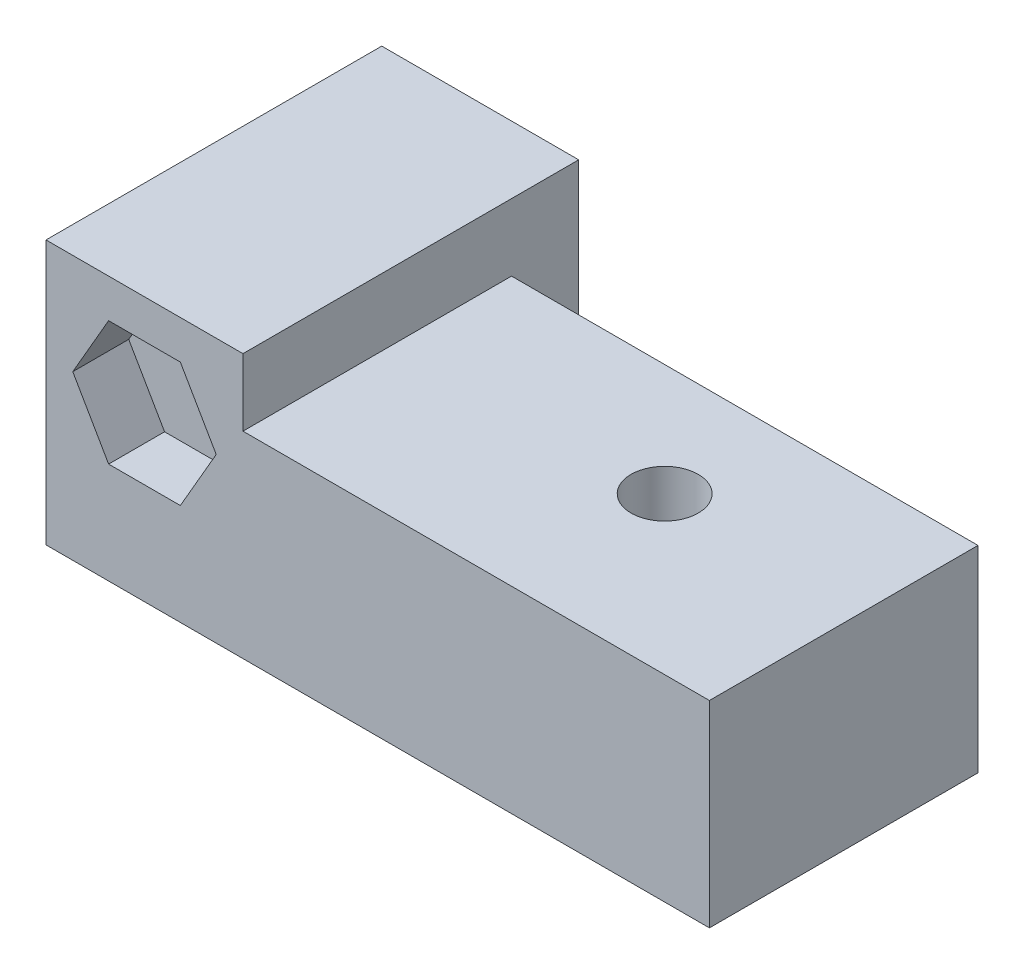
ISO-10303-21;
HEADER;
FILE_DESCRIPTION(('STEP AP214'),'2;1');
FILE_NAME('part.step','',(''),(''),'','','');
FILE_SCHEMA(('AUTOMOTIVE_DESIGN { 1 0 10303 214 1 1 1 1 }'));
ENDSEC;
DATA;
#1=APPLICATION_CONTEXT('core data for automotive mechanical design processes');
#2=APPLICATION_PROTOCOL_DEFINITION('international standard','automotive_design',2000,#1);
#3=PRODUCT_CONTEXT('',#1,'mechanical');
#4=PRODUCT('Part','Part','',(#3));
#5=PRODUCT_RELATED_PRODUCT_CATEGORY('part','',(#4));
#6=PRODUCT_DEFINITION_FORMATION('','',#4);
#7=PRODUCT_DEFINITION_CONTEXT('part definition',#1,'design');
#8=PRODUCT_DEFINITION('design','',#6,#7);
#9=PRODUCT_DEFINITION_SHAPE('','',#8);
#10=(LENGTH_UNIT() NAMED_UNIT(*) SI_UNIT(.MILLI.,.METRE.));
#11=(NAMED_UNIT(*) PLANE_ANGLE_UNIT() SI_UNIT($,.RADIAN.));
#12=(NAMED_UNIT(*) SI_UNIT($,.STERADIAN.) SOLID_ANGLE_UNIT());
#13=UNCERTAINTY_MEASURE_WITH_UNIT(LENGTH_MEASURE(1.E-05),#10,'distance_accuracy_value','');
#14=(GEOMETRIC_REPRESENTATION_CONTEXT(3) GLOBAL_UNCERTAINTY_ASSIGNED_CONTEXT((#13)) GLOBAL_UNIT_ASSIGNED_CONTEXT((#10,
#11,#12)) REPRESENTATION_CONTEXT('',''));
#15=CARTESIAN_POINT('',(0.,0.,0.));
#16=DIRECTION('',(0.,0.,1.));
#17=DIRECTION('',(1.,0.,0.));
#18=AXIS2_PLACEMENT_3D('',#15,#16,#17);
#19=CARTESIAN_POINT('',(-4.4,-0.218543147208115,5.));
#20=DIRECTION('',(0.,-1.,0.));
#21=DIRECTION('',(0.,0.,-1.));
#22=AXIS2_PLACEMENT_3D('',#19,#20,#21);
#23=CYLINDRICAL_SURFACE('',#22,1.5);
#24=CARTESIAN_POINT('',(-4.4,-8.21954314720811,5.));
#25=DIRECTION('',(0.,-1.,0.));
#26=DIRECTION('',(1.,0.,0.));
#27=AXIS2_PLACEMENT_3D('',#24,#25,#26);
#28=CIRCLE('',#27,1.5);
#29=CARTESIAN_POINT('',(-2.9,-8.21954314720811,5.));
#30=VERTEX_POINT('',#29);
#31=EDGE_CURVE('E239',#30,#30,#28,.T.);
#32=ORIENTED_EDGE('',*,*,#31,.F.);
#33=EDGE_LOOP('',(#32));
#34=FACE_BOUND('',#33,.T.);
#35=CARTESIAN_POINT('',(-4.4,-10.7195431472081,5.));
#36=DIRECTION('',(0.,-1.,0.));
#37=DIRECTION('',(0.,0.,-1.));
#38=AXIS2_PLACEMENT_3D('',#35,#36,#37);
#39=CIRCLE('',#38,1.5);
#40=CARTESIAN_POINT('',(-4.4,-10.7195431472081,3.5));
#41=VERTEX_POINT('',#40);
#42=EDGE_CURVE('E37',#41,#41,#39,.T.);
#43=ORIENTED_EDGE('',*,*,#42,.T.);
#44=EDGE_LOOP('',(#43));
#45=FACE_BOUND('',#44,.T.);
#46=ADVANCED_FACE('F33',(#34,#45),#23,.F.);
#47=CARTESIAN_POINT('',(-6.8,-1.21954314720812,15.));
#48=DIRECTION('',(1.,0.,0.));
#49=DIRECTION('',(0.,0.,-1.));
#50=AXIS2_PLACEMENT_3D('',#47,#48,#49);
#51=PLANE('',#50);
#52=DIRECTION('',(0.,-1.,0.));
#53=VECTOR('',#52,1.);
#54=CARTESIAN_POINT('',(-6.8,-1.21954314720812,10.));
#55=LINE('',#54,#53);
#56=CARTESIAN_POINT('',(-6.8,-1.21954314720812,10.));
#57=VERTEX_POINT('',#56);
#58=CARTESIAN_POINT('',(-6.8,-8.21954314720811,10.));
#59=VERTEX_POINT('',#58);
#60=EDGE_CURVE('E222',#57,#59,#55,.T.);
#61=ORIENTED_EDGE('',*,*,#60,.T.);
#62=DIRECTION('',(0.,0.,-1.));
#63=VECTOR('',#62,1.);
#64=CARTESIAN_POINT('',(-6.8,-8.21954314720811,15.));
#65=LINE('',#64,#63);
#66=CARTESIAN_POINT('',(-6.8,-8.21954314720811,0.));
#67=VERTEX_POINT('',#66);
#68=EDGE_CURVE('E233',#59,#67,#65,.T.);
#69=ORIENTED_EDGE('',*,*,#68,.T.);
#70=DIRECTION('',(0.,-1.,0.));
#71=VECTOR('',#70,1.);
#72=CARTESIAN_POINT('',(-6.8,-1.21954314720812,0.));
#73=LINE('',#72,#71);
#74=CARTESIAN_POINT('',(-6.8,-1.21954314720812,0.));
#75=VERTEX_POINT('',#74);
#76=EDGE_CURVE('E397',#75,#67,#73,.T.);
#77=ORIENTED_EDGE('',*,*,#76,.F.);
#78=DIRECTION('',(0.,0.,-1.));
#79=VECTOR('',#78,1.);
#80=CARTESIAN_POINT('',(-6.8,-1.21954314720812,15.));
#81=LINE('',#80,#79);
#82=EDGE_CURVE('E406',#57,#75,#81,.T.);
#83=ORIENTED_EDGE('',*,*,#82,.F.);
#84=EDGE_LOOP('',(#61,#69,#77,#83));
#85=FACE_BOUND('',#84,.T.);
#86=ADVANCED_FACE('F492',(#85),#51,.T.);
#87=CARTESIAN_POINT('',(-6.8,-8.21954314720811,15.));
#88=DIRECTION('',(0.,1.,0.));
#89=DIRECTION('',(0.,0.,1.));
#90=AXIS2_PLACEMENT_3D('',#87,#88,#89);
#91=PLANE('',#90);
#92=ORIENTED_EDGE('',*,*,#68,.F.);
#93=DIRECTION('',(-1.,0.,0.));
#94=VECTOR('',#93,1.);
#95=CARTESIAN_POINT('',(-6.8,-8.21954314720811,10.));
#96=LINE('',#95,#94);
#97=CARTESIAN_POINT('',(-2.,-8.21954314720812,10.));
#98=VERTEX_POINT('',#97);
#99=EDGE_CURVE('E217',#98,#59,#96,.T.);
#100=ORIENTED_EDGE('',*,*,#99,.F.);
#101=DIRECTION('',(0.,0.,-1.));
#102=VECTOR('',#101,1.);
#103=CARTESIAN_POINT('',(-2.,-8.21954314720811,15.));
#104=LINE('',#103,#102);
#105=CARTESIAN_POINT('',(-2.,-8.21954314720811,0.));
#106=VERTEX_POINT('',#105);
#107=EDGE_CURVE('E226',#98,#106,#104,.T.);
#108=ORIENTED_EDGE('',*,*,#107,.T.);
#109=DIRECTION('',(1.,0.,0.));
#110=VECTOR('',#109,1.);
#111=CARTESIAN_POINT('',(-6.8,-8.21954314720811,0.));
#112=LINE('',#111,#110);
#113=EDGE_CURVE('E400',#67,#106,#112,.T.);
#114=ORIENTED_EDGE('',*,*,#113,.F.);
#115=EDGE_LOOP('',(#92,#100,#108,#114));
#116=FACE_BOUND('',#115,.T.);
#117=ORIENTED_EDGE('',*,*,#31,.T.);
#118=EDGE_LOOP('',(#117));
#119=FACE_BOUND('',#118,.T.);
#120=ADVANCED_FACE('F237',(#116,#119),#91,.T.);
#121=CARTESIAN_POINT('',(-2.,-8.21954314720811,15.));
#122=DIRECTION('',(-1.,0.,0.));
#123=DIRECTION('',(0.,0.,1.));
#124=AXIS2_PLACEMENT_3D('',#121,#122,#123);
#125=PLANE('',#124);
#126=ORIENTED_EDGE('',*,*,#107,.F.);
#127=DIRECTION('',(0.,-1.,0.));
#128=VECTOR('',#127,1.);
#129=CARTESIAN_POINT('',(-2.,-8.21954314720812,10.));
#130=LINE('',#129,#128);
#131=CARTESIAN_POINT('',(-2.,-1.21954314720811,10.));
#132=VERTEX_POINT('',#131);
#133=EDGE_CURVE('E213',#132,#98,#130,.T.);
#134=ORIENTED_EDGE('',*,*,#133,.F.);
#135=DIRECTION('',(0.,0.,-1.));
#136=VECTOR('',#135,1.);
#137=CARTESIAN_POINT('',(-2.,-1.21954314720811,15.));
#138=LINE('',#137,#136);
#139=CARTESIAN_POINT('',(-2.,-1.21954314720811,0.));
#140=VERTEX_POINT('',#139);
#141=EDGE_CURVE('E234',#132,#140,#138,.T.);
#142=ORIENTED_EDGE('',*,*,#141,.T.);
#143=DIRECTION('',(0.,1.,0.));
#144=VECTOR('',#143,1.);
#145=CARTESIAN_POINT('',(-2.,-8.21954314720811,0.));
#146=LINE('',#145,#144);
#147=EDGE_CURVE('E229',#106,#140,#146,.T.);
#148=ORIENTED_EDGE('',*,*,#147,.F.);
#149=EDGE_LOOP('',(#126,#134,#142,#148));
#150=FACE_BOUND('',#149,.T.);
#151=ADVANCED_FACE('F227',(#150),#125,.T.);
#152=CARTESIAN_POINT('',(-2.,-1.21954314720811,15.));
#153=DIRECTION('',(0.,-1.,0.));
#154=DIRECTION('',(1.,0.,0.));
#155=AXIS2_PLACEMENT_3D('',#152,#153,#154);
#156=PLANE('',#155);
#157=ORIENTED_EDGE('',*,*,#141,.F.);
#158=DIRECTION('',(-1.,0.,0.));
#159=VECTOR('',#158,1.);
#160=CARTESIAN_POINT('',(-2.,-1.21954314720811,10.));
#161=LINE('',#160,#159);
#162=EDGE_CURVE('E219',#132,#57,#161,.T.);
#163=ORIENTED_EDGE('',*,*,#162,.T.);
#164=ORIENTED_EDGE('',*,*,#82,.T.);
#165=DIRECTION('',(-1.,0.,0.));
#166=VECTOR('',#165,1.);
#167=CARTESIAN_POINT('',(-2.,-1.21954314720811,0.));
#168=LINE('',#167,#166);
#169=EDGE_CURVE('E403',#140,#75,#168,.T.);
#170=ORIENTED_EDGE('',*,*,#169,.F.);
#171=EDGE_LOOP('',(#157,#163,#164,#170));
#172=FACE_BOUND('',#171,.T.);
#173=ADVANCED_FACE('F544',(#172),#156,.T.);
#174=CARTESIAN_POINT('',(-8.8,-0.219543147208115,15.));
#175=DIRECTION('',(0.,0.,1.));
#176=DIRECTION('',(1.,0.,0.));
#177=AXIS2_PLACEMENT_3D('',#174,#175,#176);
#178=PLANE('',#177);
#179=DIRECTION('',(0.5,0.866025403784439,0.));
#180=VECTOR('',#179,1.);
#181=CARTESIAN_POINT('',(-2.79785300299879,-7.49454314720812,15.));
#182=LINE('',#181,#180);
#183=CARTESIAN_POINT('',(-2.79785300299879,-7.49454314720812,15.));
#184=VERTEX_POINT('',#183);
#185=CARTESIAN_POINT('',(-1.19570600599758,-4.71954314720811,15.));
#186=VERTEX_POINT('',#185);
#187=EDGE_CURVE('E313',#184,#186,#182,.T.);
#188=ORIENTED_EDGE('',*,*,#187,.F.);
#189=DIRECTION('',(1.,0.,0.));
#190=VECTOR('',#189,1.);
#191=CARTESIAN_POINT('',(-6.00214699700121,-7.49454314720812,15.));
#192=LINE('',#191,#190);
#193=CARTESIAN_POINT('',(-6.00214699700121,-7.49454314720812,15.));
#194=VERTEX_POINT('',#193);
#195=EDGE_CURVE('E326',#194,#184,#192,.T.);
#196=ORIENTED_EDGE('',*,*,#195,.F.);
#197=DIRECTION('',(0.5,-0.866025403784438,0.));
#198=VECTOR('',#197,1.);
#199=CARTESIAN_POINT('',(-7.60429399400242,-4.71954314720811,15.));
#200=LINE('',#199,#198);
#201=CARTESIAN_POINT('',(-7.60429399400242,-4.71954314720811,15.));
#202=VERTEX_POINT('',#201);
#203=EDGE_CURVE('E352',#202,#194,#200,.T.);
#204=ORIENTED_EDGE('',*,*,#203,.F.);
#205=DIRECTION('',(-0.5,-0.866025403784439,0.));
#206=VECTOR('',#205,1.);
#207=CARTESIAN_POINT('',(-6.00214699700121,-1.94454314720811,15.));
#208=LINE('',#207,#206);
#209=CARTESIAN_POINT('',(-6.00214699700121,-1.94454314720811,15.));
#210=VERTEX_POINT('',#209);
#211=EDGE_CURVE('E349',#210,#202,#208,.T.);
#212=ORIENTED_EDGE('',*,*,#211,.F.);
#213=DIRECTION('',(-1.,0.,0.));
#214=VECTOR('',#213,1.);
#215=CARTESIAN_POINT('',(-2.79785300299879,-1.94454314720811,15.));
#216=LINE('',#215,#214);
#217=CARTESIAN_POINT('',(-2.79785300299879,-1.94454314720811,15.));
#218=VERTEX_POINT('',#217);
#219=EDGE_CURVE('E346',#218,#210,#216,.T.);
#220=ORIENTED_EDGE('',*,*,#219,.F.);
#221=DIRECTION('',(-0.5,0.866025403784438,0.));
#222=VECTOR('',#221,1.);
#223=CARTESIAN_POINT('',(-1.19570600599757,-4.71954314720811,15.));
#224=LINE('',#223,#222);
#225=EDGE_CURVE('E343',#186,#218,#224,.T.);
#226=ORIENTED_EDGE('',*,*,#225,.F.);
#227=EDGE_LOOP('',(#188,#196,#204,#212,#220,#226));
#228=FACE_BOUND('',#227,.T.);
#229=DIRECTION('',(-1.,0.,0.));
#230=VECTOR('',#229,1.);
#231=CARTESIAN_POINT('',(20.84,-3.21954314720811,15.));
#232=LINE('',#231,#230);
#233=CARTESIAN_POINT('',(20.84,-3.21954314720811,15.));
#234=VERTEX_POINT('',#233);
#235=CARTESIAN_POINT('',(0.,-3.21954314720811,15.));
#236=VERTEX_POINT('',#235);
#237=EDGE_CURVE('E387',#234,#236,#232,.T.);
#238=ORIENTED_EDGE('',*,*,#237,.T.);
#239=DIRECTION('',(0.,1.,0.));
#240=VECTOR('',#239,1.);
#241=CARTESIAN_POINT('',(0.,-0.219543147208115,15.));
#242=LINE('',#241,#240);
#243=CARTESIAN_POINT('',(0.,-0.219543147208115,15.));
#244=VERTEX_POINT('',#243);
#245=EDGE_CURVE('E418',#236,#244,#242,.T.);
#246=ORIENTED_EDGE('',*,*,#245,.T.);
#247=DIRECTION('',(-1.,0.,0.));
#248=VECTOR('',#247,1.);
#249=CARTESIAN_POINT('',(-6.8,-0.219543147208115,15.));
#250=LINE('',#249,#248);
#251=CARTESIAN_POINT('',(-8.8,-0.219543147208115,15.));
#252=VERTEX_POINT('',#251);
#253=EDGE_CURVE('E411',#244,#252,#250,.T.);
#254=ORIENTED_EDGE('',*,*,#253,.T.);
#255=DIRECTION('',(0.,-1.,0.));
#256=VECTOR('',#255,1.);
#257=CARTESIAN_POINT('',(-8.8,-0.219543147208115,15.));
#258=LINE('',#257,#256);
#259=CARTESIAN_POINT('',(-8.8,-12.0195431472081,15.));
#260=VERTEX_POINT('',#259);
#261=EDGE_CURVE('E414',#252,#260,#258,.T.);
#262=ORIENTED_EDGE('',*,*,#261,.T.);
#263=DIRECTION('',(-1.,0.,0.));
#264=VECTOR('',#263,1.);
#265=CARTESIAN_POINT('',(20.84,-12.0195431472081,15.));
#266=LINE('',#265,#264);
#267=CARTESIAN_POINT('',(20.84,-12.0195431472081,15.));
#268=VERTEX_POINT('',#267);
#269=EDGE_CURVE('E389',#268,#260,#266,.T.);
#270=ORIENTED_EDGE('',*,*,#269,.F.);
#271=DIRECTION('',(0.,1.,0.));
#272=VECTOR('',#271,1.);
#273=CARTESIAN_POINT('',(20.84,-3.21954314720811,15.));
#274=LINE('',#273,#272);
#275=EDGE_CURVE('E376',#268,#234,#274,.T.);
#276=ORIENTED_EDGE('',*,*,#275,.T.);
#277=EDGE_LOOP('',(#238,#246,#254,#262,#270,#276));
#278=FACE_BOUND('',#277,.T.);
#279=ADVANCED_FACE('F471',(#228,#278),#178,.T.);
#280=CARTESIAN_POINT('',(-8.8,-0.219543147208115,0.));
#281=DIRECTION('',(0.,0.,1.));
#282=DIRECTION('',(1.,0.,0.));
#283=AXIS2_PLACEMENT_3D('',#280,#281,#282);
#284=PLANE('',#283);
#285=DIRECTION('',(0.,-1.,0.));
#286=VECTOR('',#285,1.);
#287=CARTESIAN_POINT('',(-8.8,-0.219543147208115,0.));
#288=LINE('',#287,#286);
#289=CARTESIAN_POINT('',(-8.8,-0.219543147208115,0.));
#290=VERTEX_POINT('',#289);
#291=CARTESIAN_POINT('',(-8.8,-11.2195431472081,0.));
#292=VERTEX_POINT('',#291);
#293=EDGE_CURVE('E410',#290,#292,#288,.T.);
#294=ORIENTED_EDGE('',*,*,#293,.F.);
#295=DIRECTION('',(-1.,0.,0.));
#296=VECTOR('',#295,1.);
#297=CARTESIAN_POINT('',(-6.8,-0.219543147208115,0.));
#298=LINE('',#297,#296);
#299=CARTESIAN_POINT('',(0.,-0.219543147208115,0.));
#300=VERTEX_POINT('',#299);
#301=EDGE_CURVE('E415',#300,#290,#298,.T.);
#302=ORIENTED_EDGE('',*,*,#301,.F.);
#303=DIRECTION('',(0.,1.,0.));
#304=VECTOR('',#303,1.);
#305=CARTESIAN_POINT('',(0.,-0.219543147208115,0.));
#306=LINE('',#305,#304);
#307=CARTESIAN_POINT('',(0.,-11.2195431472081,0.));
#308=VERTEX_POINT('',#307);
#309=EDGE_CURVE('E426',#308,#300,#306,.T.);
#310=ORIENTED_EDGE('',*,*,#309,.F.);
#311=DIRECTION('',(1.,0.,0.));
#312=VECTOR('',#311,1.);
#313=CARTESIAN_POINT('',(0.,-11.2195431472081,0.));
#314=LINE('',#313,#312);
#315=EDGE_CURVE('E423',#292,#308,#314,.T.);
#316=ORIENTED_EDGE('',*,*,#315,.F.);
#317=EDGE_LOOP('',(#294,#302,#310,#316));
#318=FACE_BOUND('',#317,.T.);
#319=ORIENTED_EDGE('',*,*,#76,.T.);
#320=ORIENTED_EDGE('',*,*,#113,.T.);
#321=ORIENTED_EDGE('',*,*,#147,.T.);
#322=ORIENTED_EDGE('',*,*,#169,.T.);
#323=EDGE_LOOP('',(#319,#320,#321,#322));
#324=FACE_BOUND('',#323,.T.);
#325=ADVANCED_FACE('F482',(#318,#324),#284,.F.);
#326=CARTESIAN_POINT('',(-8.8,-0.219543147208115,15.));
#327=DIRECTION('',(1.,0.,0.));
#328=DIRECTION('',(0.,1.,0.));
#329=AXIS2_PLACEMENT_3D('',#326,#327,#328);
#330=PLANE('',#329);
#331=DIRECTION('',(0.,1.,0.));
#332=VECTOR('',#331,1.);
#333=CARTESIAN_POINT('',(-8.8,-13.2195431472081,9.4));
#334=LINE('',#333,#332);
#335=CARTESIAN_POINT('',(-8.8,-13.2195431472081,9.4));
#336=VERTEX_POINT('',#335);
#337=CARTESIAN_POINT('',(-8.8,-12.0195431472081,9.4));
#338=VERTEX_POINT('',#337);
#339=EDGE_CURVE('E308',#336,#338,#334,.T.);
#340=ORIENTED_EDGE('',*,*,#339,.T.);
#341=DIRECTION('',(0.,0.,1.));
#342=VECTOR('',#341,1.);
#343=CARTESIAN_POINT('',(-8.8,-12.0195431472081,3.));
#344=LINE('',#343,#342);
#345=EDGE_CURVE('E359',#338,#260,#344,.T.);
#346=ORIENTED_EDGE('',*,*,#345,.T.);
#347=ORIENTED_EDGE('',*,*,#261,.F.);
#348=DIRECTION('',(0.,0.,-1.));
#349=VECTOR('',#348,1.);
#350=CARTESIAN_POINT('',(-8.8,-0.219543147208115,15.));
#351=LINE('',#350,#349);
#352=EDGE_CURVE('E435',#252,#290,#351,.T.);
#353=ORIENTED_EDGE('',*,*,#352,.T.);
#354=ORIENTED_EDGE('',*,*,#293,.T.);
#355=DIRECTION('',(0.,0.,-1.));
#356=VECTOR('',#355,1.);
#357=CARTESIAN_POINT('',(-8.8,-11.2195431472081,15.));
#358=LINE('',#357,#356);
#359=CARTESIAN_POINT('',(-8.8,-11.2195431472081,0.6));
#360=VERTEX_POINT('',#359);
#361=EDGE_CURVE('E433',#360,#292,#358,.T.);
#362=ORIENTED_EDGE('',*,*,#361,.F.);
#363=DIRECTION('',(0.,1.,0.));
#364=VECTOR('',#363,1.);
#365=CARTESIAN_POINT('',(-8.8,-13.2195431472081,0.600000000000002));
#366=LINE('',#365,#364);
#367=CARTESIAN_POINT('',(-8.8,-13.2195431472081,0.600000000000002));
#368=VERTEX_POINT('',#367);
#369=EDGE_CURVE('E310',#368,#360,#366,.T.);
#370=ORIENTED_EDGE('',*,*,#369,.F.);
#371=DIRECTION('',(0.,0.,1.));
#372=VECTOR('',#371,1.);
#373=CARTESIAN_POINT('',(-8.8,-13.2195431472081,0.600000000000002));
#374=LINE('',#373,#372);
#375=EDGE_CURVE('E296',#368,#336,#374,.T.);
#376=ORIENTED_EDGE('',*,*,#375,.T.);
#377=EDGE_LOOP('',(#340,#346,#347,#353,#354,#362,#370,#376));
#378=FACE_BOUND('',#377,.T.);
#379=ADVANCED_FACE('F35',(#378),#330,.F.);
#380=CARTESIAN_POINT('',(0.,-11.2195431472081,15.));
#381=DIRECTION('',(0.,1.,0.));
#382=DIRECTION('',(0.,0.,1.));
#383=AXIS2_PLACEMENT_3D('',#380,#381,#382);
#384=PLANE('',#383);
#385=DIRECTION('',(0.,0.,-1.));
#386=VECTOR('',#385,1.);
#387=CARTESIAN_POINT('',(0.,-11.2195431472081,15.));
#388=LINE('',#387,#386);
#389=CARTESIAN_POINT('',(0.,-11.2195431472081,0.6));
#390=VERTEX_POINT('',#389);
#391=EDGE_CURVE('E431',#390,#308,#388,.T.);
#392=ORIENTED_EDGE('',*,*,#391,.F.);
#393=DIRECTION('',(-1.,0.,0.));
#394=VECTOR('',#393,1.);
#395=CARTESIAN_POINT('',(-8.8,-11.2195431472081,0.600000000000002));
#396=LINE('',#395,#394);
#397=EDGE_CURVE('E57',#390,#360,#396,.T.);
#398=ORIENTED_EDGE('',*,*,#397,.T.);
#399=ORIENTED_EDGE('',*,*,#361,.T.);
#400=ORIENTED_EDGE('',*,*,#315,.T.);
#401=EDGE_LOOP('',(#392,#398,#399,#400));
#402=FACE_BOUND('',#401,.T.);
#403=ADVANCED_FACE('F484',(#402),#384,.F.);
#404=CARTESIAN_POINT('',(0.,-0.219543147208115,15.));
#405=DIRECTION('',(-1.,0.,0.));
#406=DIRECTION('',(0.,-1.,0.));
#407=AXIS2_PLACEMENT_3D('',#404,#405,#406);
#408=PLANE('',#407);
#409=DIRECTION('',(0.,0.,-1.));
#410=VECTOR('',#409,1.);
#411=CARTESIAN_POINT('',(0.,-3.21954314720811,15.));
#412=LINE('',#411,#410);
#413=CARTESIAN_POINT('',(0.,-3.21954314720811,3.));
#414=VERTEX_POINT('',#413);
#415=EDGE_CURVE('E223',#236,#414,#412,.T.);
#416=ORIENTED_EDGE('',*,*,#415,.T.);
#417=DIRECTION('',(0.,-1.,0.));
#418=VECTOR('',#417,1.);
#419=CARTESIAN_POINT('',(0.,-0.219543147208117,3.));
#420=LINE('',#419,#418);
#421=CARTESIAN_POINT('',(0.,-12.0195431472081,3.));
#422=VERTEX_POINT('',#421);
#423=EDGE_CURVE('E439',#414,#422,#420,.T.);
#424=ORIENTED_EDGE('',*,*,#423,.T.);
#425=DIRECTION('',(0.,0.,1.));
#426=VECTOR('',#425,1.);
#427=CARTESIAN_POINT('',(0.,-12.0195431472081,3.));
#428=LINE('',#427,#426);
#429=CARTESIAN_POINT('',(0.,-12.0195431472081,9.4));
#430=VERTEX_POINT('',#429);
#431=EDGE_CURVE('E12',#422,#430,#428,.T.);
#432=ORIENTED_EDGE('',*,*,#431,.T.);
#433=DIRECTION('',(0.,1.,0.));
#434=VECTOR('',#433,1.);
#435=CARTESIAN_POINT('',(0.,-13.2195431472081,9.4));
#436=LINE('',#435,#434);
#437=CARTESIAN_POINT('',(0.,-13.2195431472081,9.4));
#438=VERTEX_POINT('',#437);
#439=EDGE_CURVE('E317',#438,#430,#436,.T.);
#440=ORIENTED_EDGE('',*,*,#439,.F.);
#441=DIRECTION('',(0.,0.,-1.));
#442=VECTOR('',#441,1.);
#443=CARTESIAN_POINT('',(0.,-13.2195431472081,0.6));
#444=LINE('',#443,#442);
#445=CARTESIAN_POINT('',(0.,-13.2195431472081,0.6));
#446=VERTEX_POINT('',#445);
#447=EDGE_CURVE('E302',#438,#446,#444,.T.);
#448=ORIENTED_EDGE('',*,*,#447,.T.);
#449=DIRECTION('',(0.,1.,0.));
#450=VECTOR('',#449,1.);
#451=CARTESIAN_POINT('',(0.,-13.2195431472081,0.6));
#452=LINE('',#451,#450);
#453=EDGE_CURVE('E314',#446,#390,#452,.T.);
#454=ORIENTED_EDGE('',*,*,#453,.T.);
#455=ORIENTED_EDGE('',*,*,#391,.T.);
#456=ORIENTED_EDGE('',*,*,#309,.T.);
#457=DIRECTION('',(0.,0.,-1.));
#458=VECTOR('',#457,1.);
#459=CARTESIAN_POINT('',(0.,-0.219543147208115,15.));
#460=LINE('',#459,#458);
#461=EDGE_CURVE('E420',#244,#300,#460,.T.);
#462=ORIENTED_EDGE('',*,*,#461,.F.);
#463=ORIENTED_EDGE('',*,*,#245,.F.);
#464=EDGE_LOOP('',(#416,#424,#432,#440,#448,#454,#455,#456,#462,#463));
#465=FACE_BOUND('',#464,.T.);
#466=ADVANCED_FACE('F456',(#465),#408,.F.);
#467=CARTESIAN_POINT('',(-6.8,-0.219543147208115,15.));
#468=DIRECTION('',(0.,-1.,0.));
#469=DIRECTION('',(0.,0.,-1.));
#470=AXIS2_PLACEMENT_3D('',#467,#468,#469);
#471=PLANE('',#470);
#472=ORIENTED_EDGE('',*,*,#301,.T.);
#473=ORIENTED_EDGE('',*,*,#352,.F.);
#474=ORIENTED_EDGE('',*,*,#253,.F.);
#475=ORIENTED_EDGE('',*,*,#461,.T.);
#476=EDGE_LOOP('',(#472,#473,#474,#475));
#477=FACE_BOUND('',#476,.T.);
#478=ADVANCED_FACE('F476',(#477),#471,.F.);
#479=CARTESIAN_POINT('',(-7.,-8.21954314720812,10.));
#480=DIRECTION('',(0.,0.,1.));
#481=DIRECTION('',(1.,0.,0.));
#482=AXIS2_PLACEMENT_3D('',#479,#480,#481);
#483=PLANE('',#482);
#484=ORIENTED_EDGE('',*,*,#133,.T.);
#485=ORIENTED_EDGE('',*,*,#99,.T.);
#486=ORIENTED_EDGE('',*,*,#60,.F.);
#487=ORIENTED_EDGE('',*,*,#162,.F.);
#488=EDGE_LOOP('',(#484,#485,#486,#487));
#489=FACE_BOUND('',#488,.T.);
#490=ADVANCED_FACE('F215',(#489),#483,.F.);
#491=CARTESIAN_POINT('',(20.84,-3.21954314720811,3.));
#492=DIRECTION('',(0.,0.,-1.));
#493=DIRECTION('',(0.,1.,0.));
#494=AXIS2_PLACEMENT_3D('',#491,#492,#493);
#495=PLANE('',#494);
#496=DIRECTION('',(-1.,0.,0.));
#497=VECTOR('',#496,1.);
#498=CARTESIAN_POINT('',(20.84,-12.0195431472081,3.));
#499=LINE('',#498,#497);
#500=CARTESIAN_POINT('',(20.84,-12.0195431472081,3.));
#501=VERTEX_POINT('',#500);
#502=EDGE_CURVE('E382',#501,#422,#499,.T.);
#503=ORIENTED_EDGE('',*,*,#502,.T.);
#504=ORIENTED_EDGE('',*,*,#423,.F.);
#505=DIRECTION('',(-1.,0.,0.));
#506=VECTOR('',#505,1.);
#507=CARTESIAN_POINT('',(20.84,-3.21954314720811,3.));
#508=LINE('',#507,#506);
#509=CARTESIAN_POINT('',(20.84,-3.21954314720811,3.));
#510=VERTEX_POINT('',#509);
#511=EDGE_CURVE('E384',#510,#414,#508,.T.);
#512=ORIENTED_EDGE('',*,*,#511,.F.);
#513=DIRECTION('',(0.,-1.,0.));
#514=VECTOR('',#513,1.);
#515=CARTESIAN_POINT('',(20.84,-3.21954314720811,3.));
#516=LINE('',#515,#514);
#517=EDGE_CURVE('E370',#510,#501,#516,.T.);
#518=ORIENTED_EDGE('',*,*,#517,.T.);
#519=EDGE_LOOP('',(#503,#504,#512,#518));
#520=FACE_BOUND('',#519,.T.);
#521=ADVANCED_FACE('F460',(#520),#495,.T.);
#522=CARTESIAN_POINT('',(20.84,-3.21954314720811,3.));
#523=DIRECTION('',(0.,1.,0.));
#524=DIRECTION('',(-1.,0.,0.));
#525=AXIS2_PLACEMENT_3D('',#522,#523,#524);
#526=PLANE('',#525);
#527=CARTESIAN_POINT('',(11.84,-3.21954314720811,8.));
#528=DIRECTION('',(0.,1.,0.));
#529=DIRECTION('',(-1.,0.,0.));
#530=AXIS2_PLACEMENT_3D('',#527,#528,#529);
#531=CIRCLE('',#530,1.5);
#532=CARTESIAN_POINT('',(10.34,-3.21954314720811,8.));
#533=VERTEX_POINT('',#532);
#534=EDGE_CURVE('E242',#533,#533,#531,.T.);
#535=ORIENTED_EDGE('',*,*,#534,.F.);
#536=EDGE_LOOP('',(#535));
#537=FACE_BOUND('',#536,.T.);
#538=ORIENTED_EDGE('',*,*,#415,.F.);
#539=ORIENTED_EDGE('',*,*,#237,.F.);
#540=DIRECTION('',(0.,0.,-1.));
#541=VECTOR('',#540,1.);
#542=CARTESIAN_POINT('',(20.84,-3.21954314720811,3.));
#543=LINE('',#542,#541);
#544=EDGE_CURVE('E379',#234,#510,#543,.T.);
#545=ORIENTED_EDGE('',*,*,#544,.T.);
#546=ORIENTED_EDGE('',*,*,#511,.T.);
#547=EDGE_LOOP('',(#538,#539,#545,#546));
#548=FACE_BOUND('',#547,.T.);
#549=ADVANCED_FACE('F468',(#537,#548),#526,.T.);
#550=CARTESIAN_POINT('',(20.84,-12.0195431472081,3.));
#551=DIRECTION('',(0.,-1.,0.));
#552=DIRECTION('',(1.,0.,0.));
#553=AXIS2_PLACEMENT_3D('',#550,#551,#552);
#554=PLANE('',#553);
#555=ORIENTED_EDGE('',*,*,#431,.F.);
#556=ORIENTED_EDGE('',*,*,#502,.F.);
#557=DIRECTION('',(0.,0.,1.));
#558=VECTOR('',#557,1.);
#559=CARTESIAN_POINT('',(20.84,-12.0195431472081,3.));
#560=LINE('',#559,#558);
#561=EDGE_CURVE('E373',#501,#268,#560,.T.);
#562=ORIENTED_EDGE('',*,*,#561,.T.);
#563=ORIENTED_EDGE('',*,*,#269,.T.);
#564=ORIENTED_EDGE('',*,*,#345,.F.);
#565=DIRECTION('',(-1.,0.,0.));
#566=VECTOR('',#565,1.);
#567=CARTESIAN_POINT('',(20.84,-12.0195431472081,9.4));
#568=LINE('',#567,#566);
#569=EDGE_CURVE('E42',#430,#338,#568,.T.);
#570=ORIENTED_EDGE('',*,*,#569,.F.);
#571=EDGE_LOOP('',(#555,#556,#562,#563,#564,#570));
#572=FACE_BOUND('',#571,.T.);
#573=ADVANCED_FACE('F457',(#572),#554,.T.);
#574=CARTESIAN_POINT('',(20.84,-12.0195431472081,3.));
#575=DIRECTION('',(-1.,0.,0.));
#576=DIRECTION('',(0.,-1.,0.));
#577=AXIS2_PLACEMENT_3D('',#574,#575,#576);
#578=PLANE('',#577);
#579=ORIENTED_EDGE('',*,*,#517,.F.);
#580=ORIENTED_EDGE('',*,*,#544,.F.);
#581=ORIENTED_EDGE('',*,*,#275,.F.);
#582=ORIENTED_EDGE('',*,*,#561,.F.);
#583=EDGE_LOOP('',(#579,#580,#581,#582));
#584=FACE_BOUND('',#583,.T.);
#585=ADVANCED_FACE('F464',(#584),#578,.F.);
#586=CARTESIAN_POINT('',(-2.79785300299879,-7.49454314720812,12.5));
#587=DIRECTION('',(0.866025403784439,-0.5,0.));
#588=DIRECTION('',(0.5,0.866025403784439,0.));
#589=AXIS2_PLACEMENT_3D('',#586,#587,#588);
#590=PLANE('',#589);
#591=ORIENTED_EDGE('',*,*,#187,.T.);
#592=DIRECTION('',(0.,0.,1.));
#593=VECTOR('',#592,1.);
#594=CARTESIAN_POINT('',(-1.19570600599757,-4.71954314720811,12.5));
#595=LINE('',#594,#593);
#596=CARTESIAN_POINT('',(-1.19570600599757,-4.71954314720811,12.5));
#597=VERTEX_POINT('',#596);
#598=EDGE_CURVE('E341',#597,#186,#595,.T.);
#599=ORIENTED_EDGE('',*,*,#598,.F.);
#600=DIRECTION('',(0.5,0.866025403784439,0.));
#601=VECTOR('',#600,1.);
#602=CARTESIAN_POINT('',(-2.79785300299879,-7.49454314720812,12.5));
#603=LINE('',#602,#601);
#604=CARTESIAN_POINT('',(-2.79785300299879,-7.49454314720812,12.5));
#605=VERTEX_POINT('',#604);
#606=EDGE_CURVE('E322',#605,#597,#603,.T.);
#607=ORIENTED_EDGE('',*,*,#606,.F.);
#608=DIRECTION('',(0.,0.,1.));
#609=VECTOR('',#608,1.);
#610=CARTESIAN_POINT('',(-2.79785300299879,-7.49454314720812,12.5));
#611=LINE('',#610,#609);
#612=EDGE_CURVE('E357',#605,#184,#611,.T.);
#613=ORIENTED_EDGE('',*,*,#612,.T.);
#614=EDGE_LOOP('',(#591,#599,#607,#613));
#615=FACE_BOUND('',#614,.T.);
#616=ADVANCED_FACE('F514',(#615),#590,.F.);
#617=CARTESIAN_POINT('',(-6.00214699700121,-7.49454314720812,12.5));
#618=DIRECTION('',(0.,-1.,0.));
#619=DIRECTION('',(0.,0.,-1.));
#620=AXIS2_PLACEMENT_3D('',#617,#618,#619);
#621=PLANE('',#620);
#622=ORIENTED_EDGE('',*,*,#195,.T.);
#623=ORIENTED_EDGE('',*,*,#612,.F.);
#624=DIRECTION('',(1.,0.,0.));
#625=VECTOR('',#624,1.);
#626=CARTESIAN_POINT('',(-6.00214699700121,-7.49454314720812,12.5));
#627=LINE('',#626,#625);
#628=CARTESIAN_POINT('',(-6.00214699700121,-7.49454314720812,12.5));
#629=VERTEX_POINT('',#628);
#630=EDGE_CURVE('E338',#629,#605,#627,.T.);
#631=ORIENTED_EDGE('',*,*,#630,.F.);
#632=DIRECTION('',(0.,0.,1.));
#633=VECTOR('',#632,1.);
#634=CARTESIAN_POINT('',(-6.00214699700121,-7.49454314720812,12.5));
#635=LINE('',#634,#633);
#636=EDGE_CURVE('E360',#629,#194,#635,.T.);
#637=ORIENTED_EDGE('',*,*,#636,.T.);
#638=EDGE_LOOP('',(#622,#623,#631,#637));
#639=FACE_BOUND('',#638,.T.);
#640=ADVANCED_FACE('F510',(#639),#621,.F.);
#641=CARTESIAN_POINT('',(-7.60429399400242,-4.71954314720811,12.5));
#642=DIRECTION('',(-0.866025403784439,-0.5,0.));
#643=DIRECTION('',(0.5,-0.866025403784439,0.));
#644=AXIS2_PLACEMENT_3D('',#641,#642,#643);
#645=PLANE('',#644);
#646=ORIENTED_EDGE('',*,*,#203,.T.);
#647=ORIENTED_EDGE('',*,*,#636,.F.);
#648=DIRECTION('',(0.5,-0.866025403784438,0.));
#649=VECTOR('',#648,1.);
#650=CARTESIAN_POINT('',(-7.60429399400242,-4.71954314720811,12.5));
#651=LINE('',#650,#649);
#652=CARTESIAN_POINT('',(-7.60429399400242,-4.71954314720811,12.5));
#653=VERTEX_POINT('',#652);
#654=EDGE_CURVE('E335',#653,#629,#651,.T.);
#655=ORIENTED_EDGE('',*,*,#654,.F.);
#656=DIRECTION('',(0.,0.,1.));
#657=VECTOR('',#656,1.);
#658=CARTESIAN_POINT('',(-7.60429399400242,-4.71954314720811,12.5));
#659=LINE('',#658,#657);
#660=EDGE_CURVE('E362',#653,#202,#659,.T.);
#661=ORIENTED_EDGE('',*,*,#660,.T.);
#662=EDGE_LOOP('',(#646,#647,#655,#661));
#663=FACE_BOUND('',#662,.T.);
#664=ADVANCED_FACE('F513',(#663),#645,.F.);
#665=CARTESIAN_POINT('',(-6.00214699700121,-1.94454314720811,12.5));
#666=DIRECTION('',(-0.866025403784439,0.5,0.));
#667=DIRECTION('',(-0.5,-0.866025403784439,0.));
#668=AXIS2_PLACEMENT_3D('',#665,#666,#667);
#669=PLANE('',#668);
#670=ORIENTED_EDGE('',*,*,#211,.T.);
#671=ORIENTED_EDGE('',*,*,#660,.F.);
#672=DIRECTION('',(-0.5,-0.866025403784439,0.));
#673=VECTOR('',#672,1.);
#674=CARTESIAN_POINT('',(-6.00214699700121,-1.94454314720811,12.5));
#675=LINE('',#674,#673);
#676=CARTESIAN_POINT('',(-6.00214699700121,-1.94454314720811,12.5));
#677=VERTEX_POINT('',#676);
#678=EDGE_CURVE('E332',#677,#653,#675,.T.);
#679=ORIENTED_EDGE('',*,*,#678,.F.);
#680=DIRECTION('',(0.,0.,1.));
#681=VECTOR('',#680,1.);
#682=CARTESIAN_POINT('',(-6.00214699700121,-1.94454314720811,12.5));
#683=LINE('',#682,#681);
#684=EDGE_CURVE('E364',#677,#210,#683,.T.);
#685=ORIENTED_EDGE('',*,*,#684,.T.);
#686=EDGE_LOOP('',(#670,#671,#679,#685));
#687=FACE_BOUND('',#686,.T.);
#688=ADVANCED_FACE('F518',(#687),#669,.F.);
#689=CARTESIAN_POINT('',(-2.79785300299879,-1.94454314720811,12.5));
#690=DIRECTION('',(0.,1.,0.));
#691=DIRECTION('',(0.,0.,1.));
#692=AXIS2_PLACEMENT_3D('',#689,#690,#691);
#693=PLANE('',#692);
#694=ORIENTED_EDGE('',*,*,#219,.T.);
#695=ORIENTED_EDGE('',*,*,#684,.F.);
#696=DIRECTION('',(-1.,0.,0.));
#697=VECTOR('',#696,1.);
#698=CARTESIAN_POINT('',(-2.79785300299879,-1.94454314720811,12.5));
#699=LINE('',#698,#697);
#700=CARTESIAN_POINT('',(-2.79785300299879,-1.94454314720811,12.5));
#701=VERTEX_POINT('',#700);
#702=EDGE_CURVE('E329',#701,#677,#699,.T.);
#703=ORIENTED_EDGE('',*,*,#702,.F.);
#704=DIRECTION('',(0.,0.,1.));
#705=VECTOR('',#704,1.);
#706=CARTESIAN_POINT('',(-2.79785300299879,-1.94454314720811,12.5));
#707=LINE('',#706,#705);
#708=EDGE_CURVE('E366',#701,#218,#707,.T.);
#709=ORIENTED_EDGE('',*,*,#708,.T.);
#710=EDGE_LOOP('',(#694,#695,#703,#709));
#711=FACE_BOUND('',#710,.T.);
#712=ADVANCED_FACE('F522',(#711),#693,.F.);
#713=CARTESIAN_POINT('',(-1.19570600599757,-4.71954314720811,12.5));
#714=DIRECTION('',(0.866025403784438,0.5,0.));
#715=DIRECTION('',(-0.5,0.866025403784438,0.));
#716=AXIS2_PLACEMENT_3D('',#713,#714,#715);
#717=PLANE('',#716);
#718=ORIENTED_EDGE('',*,*,#225,.T.);
#719=ORIENTED_EDGE('',*,*,#708,.F.);
#720=DIRECTION('',(-0.5,0.866025403784438,0.));
#721=VECTOR('',#720,1.);
#722=CARTESIAN_POINT('',(-1.19570600599757,-4.71954314720811,12.5));
#723=LINE('',#722,#721);
#724=EDGE_CURVE('E325',#597,#701,#723,.T.);
#725=ORIENTED_EDGE('',*,*,#724,.F.);
#726=ORIENTED_EDGE('',*,*,#598,.T.);
#727=EDGE_LOOP('',(#718,#719,#725,#726));
#728=FACE_BOUND('',#727,.T.);
#729=ADVANCED_FACE('F508',(#728),#717,.F.);
#730=CARTESIAN_POINT('',(-1.19570600599757,-4.71954314720811,12.5));
#731=DIRECTION('',(0.,0.,1.));
#732=DIRECTION('',(1.,0.,0.));
#733=AXIS2_PLACEMENT_3D('',#730,#731,#732);
#734=PLANE('',#733);
#735=ORIENTED_EDGE('',*,*,#606,.T.);
#736=ORIENTED_EDGE('',*,*,#724,.T.);
#737=ORIENTED_EDGE('',*,*,#702,.T.);
#738=ORIENTED_EDGE('',*,*,#678,.T.);
#739=ORIENTED_EDGE('',*,*,#654,.T.);
#740=ORIENTED_EDGE('',*,*,#630,.T.);
#741=EDGE_LOOP('',(#735,#736,#737,#738,#739,#740));
#742=FACE_BOUND('',#741,.T.);
#743=ADVANCED_FACE('F505',(#742),#734,.T.);
#744=CARTESIAN_POINT('',(-8.8,-13.2195431472081,0.600000000000002));
#745=DIRECTION('',(0.,0.,-1.));
#746=DIRECTION('',(-1.,0.,0.));
#747=AXIS2_PLACEMENT_3D('',#744,#745,#746);
#748=PLANE('',#747);
#749=ORIENTED_EDGE('',*,*,#397,.F.);
#750=ORIENTED_EDGE('',*,*,#453,.F.);
#751=DIRECTION('',(-1.,0.,0.));
#752=VECTOR('',#751,1.);
#753=CARTESIAN_POINT('',(-8.8,-13.2195431472081,0.600000000000002));
#754=LINE('',#753,#752);
#755=EDGE_CURVE('E305',#446,#368,#754,.T.);
#756=ORIENTED_EDGE('',*,*,#755,.T.);
#757=ORIENTED_EDGE('',*,*,#369,.T.);
#758=EDGE_LOOP('',(#749,#750,#756,#757));
#759=FACE_BOUND('',#758,.T.);
#760=ADVANCED_FACE('F454',(#759),#748,.T.);
#761=CARTESIAN_POINT('',(-8.8,-13.2195431472081,9.4));
#762=DIRECTION('',(0.,0.,1.));
#763=DIRECTION('',(1.,0.,0.));
#764=AXIS2_PLACEMENT_3D('',#761,#762,#763);
#765=PLANE('',#764);
#766=ORIENTED_EDGE('',*,*,#439,.T.);
#767=ORIENTED_EDGE('',*,*,#569,.T.);
#768=ORIENTED_EDGE('',*,*,#339,.F.);
#769=DIRECTION('',(1.,0.,0.));
#770=VECTOR('',#769,1.);
#771=CARTESIAN_POINT('',(-8.8,-13.2195431472081,9.4));
#772=LINE('',#771,#770);
#773=EDGE_CURVE('E299',#336,#438,#772,.T.);
#774=ORIENTED_EDGE('',*,*,#773,.T.);
#775=EDGE_LOOP('',(#766,#767,#768,#774));
#776=FACE_BOUND('',#775,.T.);
#777=ADVANCED_FACE('F443',(#776),#765,.T.);
#778=CARTESIAN_POINT('',(-8.8,-13.2195431472081,9.4));
#779=DIRECTION('',(0.,1.,0.));
#780=DIRECTION('',(0.,0.,1.));
#781=AXIS2_PLACEMENT_3D('',#778,#779,#780);
#782=PLANE('',#781);
#783=DIRECTION('',(0.866025403784439,0.,0.5));
#784=VECTOR('',#783,1.);
#785=CARTESIAN_POINT('',(-4.4,-13.2195431472081,1.79570600599758));
#786=LINE('',#785,#784);
#787=CARTESIAN_POINT('',(-4.4,-13.2195431472081,1.79570600599758));
#788=VERTEX_POINT('',#787);
#789=CARTESIAN_POINT('',(-1.625,-13.2195431472081,3.39785300299879));
#790=VERTEX_POINT('',#789);
#791=EDGE_CURVE('E271',#788,#790,#786,.T.);
#792=ORIENTED_EDGE('',*,*,#791,.F.);
#793=DIRECTION('',(0.866025403784439,0.,-0.5));
#794=VECTOR('',#793,1.);
#795=CARTESIAN_POINT('',(-7.175,-13.2195431472081,3.39785300299879));
#796=LINE('',#795,#794);
#797=CARTESIAN_POINT('',(-7.175,-13.2195431472081,3.39785300299879));
#798=VERTEX_POINT('',#797);
#799=EDGE_CURVE('E49',#798,#788,#796,.T.);
#800=ORIENTED_EDGE('',*,*,#799,.F.);
#801=DIRECTION('',(0.,0.,-1.));
#802=VECTOR('',#801,1.);
#803=CARTESIAN_POINT('',(-7.175,-13.2195431472081,6.60214699700121));
#804=LINE('',#803,#802);
#805=CARTESIAN_POINT('',(-7.175,-13.2195431472081,6.60214699700121));
#806=VERTEX_POINT('',#805);
#807=EDGE_CURVE('E254',#806,#798,#804,.T.);
#808=ORIENTED_EDGE('',*,*,#807,.F.);
#809=DIRECTION('',(-0.866025403784439,0.,-0.5));
#810=VECTOR('',#809,1.);
#811=CARTESIAN_POINT('',(-4.4,-13.2195431472081,8.20429399400242));
#812=LINE('',#811,#810);
#813=CARTESIAN_POINT('',(-4.4,-13.2195431472081,8.20429399400242));
#814=VERTEX_POINT('',#813);
#815=EDGE_CURVE('E280',#814,#806,#812,.T.);
#816=ORIENTED_EDGE('',*,*,#815,.F.);
#817=DIRECTION('',(-0.866025403784439,0.,0.5));
#818=VECTOR('',#817,1.);
#819=CARTESIAN_POINT('',(-1.625,-13.2195431472081,6.60214699700121));
#820=LINE('',#819,#818);
#821=CARTESIAN_POINT('',(-1.625,-13.2195431472081,6.60214699700121));
#822=VERTEX_POINT('',#821);
#823=EDGE_CURVE('E277',#822,#814,#820,.T.);
#824=ORIENTED_EDGE('',*,*,#823,.F.);
#825=DIRECTION('',(0.,0.,1.));
#826=VECTOR('',#825,1.);
#827=CARTESIAN_POINT('',(-1.625,-13.2195431472081,3.39785300299879));
#828=LINE('',#827,#826);
#829=EDGE_CURVE('E274',#790,#822,#828,.T.);
#830=ORIENTED_EDGE('',*,*,#829,.F.);
#831=EDGE_LOOP('',(#792,#800,#808,#816,#824,#830));
#832=FACE_BOUND('',#831,.T.);
#833=ORIENTED_EDGE('',*,*,#375,.F.);
#834=ORIENTED_EDGE('',*,*,#755,.F.);
#835=ORIENTED_EDGE('',*,*,#447,.F.);
#836=ORIENTED_EDGE('',*,*,#773,.F.);
#837=EDGE_LOOP('',(#833,#834,#835,#836));
#838=FACE_BOUND('',#837,.T.);
#839=ADVANCED_FACE('F451',(#832,#838),#782,.F.);
#840=CARTESIAN_POINT('',(-7.175,-10.7195431472081,3.39785300299879));
#841=DIRECTION('',(-0.5,0.,-0.866025403784439));
#842=DIRECTION('',(-0.866025403784439,0.,0.5));
#843=AXIS2_PLACEMENT_3D('',#840,#841,#842);
#844=PLANE('',#843);
#845=ORIENTED_EDGE('',*,*,#799,.T.);
#846=DIRECTION('',(0.,-1.,0.));
#847=VECTOR('',#846,1.);
#848=CARTESIAN_POINT('',(-4.4,-10.7195431472081,1.79570600599758));
#849=LINE('',#848,#847);
#850=CARTESIAN_POINT('',(-4.4,-10.7195431472081,1.79570600599758));
#851=VERTEX_POINT('',#850);
#852=EDGE_CURVE('E269',#851,#788,#849,.T.);
#853=ORIENTED_EDGE('',*,*,#852,.F.);
#854=DIRECTION('',(0.866025403784439,0.,-0.5));
#855=VECTOR('',#854,1.);
#856=CARTESIAN_POINT('',(-7.175,-10.7195431472081,3.39785300299879));
#857=LINE('',#856,#855);
#858=CARTESIAN_POINT('',(-7.175,-10.7195431472081,3.39785300299879));
#859=VERTEX_POINT('',#858);
#860=EDGE_CURVE('E250',#859,#851,#857,.T.);
#861=ORIENTED_EDGE('',*,*,#860,.F.);
#862=DIRECTION('',(0.,-1.,0.));
#863=VECTOR('',#862,1.);
#864=CARTESIAN_POINT('',(-7.175,-10.7195431472081,3.39785300299879));
#865=LINE('',#864,#863);
#866=EDGE_CURVE('E285',#859,#798,#865,.T.);
#867=ORIENTED_EDGE('',*,*,#866,.T.);
#868=EDGE_LOOP('',(#845,#853,#861,#867));
#869=FACE_BOUND('',#868,.T.);
#870=ADVANCED_FACE('F633',(#869),#844,.F.);
#871=CARTESIAN_POINT('',(-7.175,-10.7195431472081,6.60214699700121));
#872=DIRECTION('',(-1.,0.,0.));
#873=DIRECTION('',(0.,-1.,0.));
#874=AXIS2_PLACEMENT_3D('',#871,#872,#873);
#875=PLANE('',#874);
#876=ORIENTED_EDGE('',*,*,#807,.T.);
#877=ORIENTED_EDGE('',*,*,#866,.F.);
#878=DIRECTION('',(0.,0.,-1.));
#879=VECTOR('',#878,1.);
#880=CARTESIAN_POINT('',(-7.175,-10.7195431472081,6.60214699700121));
#881=LINE('',#880,#879);
#882=CARTESIAN_POINT('',(-7.175,-10.7195431472081,6.60214699700121));
#883=VERTEX_POINT('',#882);
#884=EDGE_CURVE('E266',#883,#859,#881,.T.);
#885=ORIENTED_EDGE('',*,*,#884,.F.);
#886=DIRECTION('',(0.,-1.,0.));
#887=VECTOR('',#886,1.);
#888=CARTESIAN_POINT('',(-7.175,-10.7195431472081,6.60214699700121));
#889=LINE('',#888,#887);
#890=EDGE_CURVE('E287',#883,#806,#889,.T.);
#891=ORIENTED_EDGE('',*,*,#890,.T.);
#892=EDGE_LOOP('',(#876,#877,#885,#891));
#893=FACE_BOUND('',#892,.T.);
#894=ADVANCED_FACE('F641',(#893),#875,.F.);
#895=CARTESIAN_POINT('',(-4.4,-10.7195431472081,8.20429399400242));
#896=DIRECTION('',(-0.5,0.,0.866025403784439));
#897=DIRECTION('',(0.866025403784439,0.,0.5));
#898=AXIS2_PLACEMENT_3D('',#895,#896,#897);
#899=PLANE('',#898);
#900=ORIENTED_EDGE('',*,*,#815,.T.);
#901=ORIENTED_EDGE('',*,*,#890,.F.);
#902=DIRECTION('',(-0.866025403784439,0.,-0.5));
#903=VECTOR('',#902,1.);
#904=CARTESIAN_POINT('',(-4.4,-10.7195431472081,8.20429399400242));
#905=LINE('',#904,#903);
#906=CARTESIAN_POINT('',(-4.4,-10.7195431472081,8.20429399400242));
#907=VERTEX_POINT('',#906);
#908=EDGE_CURVE('E263',#907,#883,#905,.T.);
#909=ORIENTED_EDGE('',*,*,#908,.F.);
#910=DIRECTION('',(0.,-1.,0.));
#911=VECTOR('',#910,1.);
#912=CARTESIAN_POINT('',(-4.4,-10.7195431472081,8.20429399400242));
#913=LINE('',#912,#911);
#914=EDGE_CURVE('E289',#907,#814,#913,.T.);
#915=ORIENTED_EDGE('',*,*,#914,.T.);
#916=EDGE_LOOP('',(#900,#901,#909,#915));
#917=FACE_BOUND('',#916,.T.);
#918=ADVANCED_FACE('F648',(#917),#899,.F.);
#919=CARTESIAN_POINT('',(-1.625,-10.7195431472081,6.60214699700121));
#920=DIRECTION('',(0.5,0.,0.866025403784439));
#921=DIRECTION('',(0.866025403784439,0.,-0.5));
#922=AXIS2_PLACEMENT_3D('',#919,#920,#921);
#923=PLANE('',#922);
#924=ORIENTED_EDGE('',*,*,#823,.T.);
#925=ORIENTED_EDGE('',*,*,#914,.F.);
#926=DIRECTION('',(-0.866025403784439,0.,0.5));
#927=VECTOR('',#926,1.);
#928=CARTESIAN_POINT('',(-1.625,-10.7195431472081,6.60214699700121));
#929=LINE('',#928,#927);
#930=CARTESIAN_POINT('',(-1.625,-10.7195431472081,6.60214699700121));
#931=VERTEX_POINT('',#930);
#932=EDGE_CURVE('E260',#931,#907,#929,.T.);
#933=ORIENTED_EDGE('',*,*,#932,.F.);
#934=DIRECTION('',(0.,-1.,0.));
#935=VECTOR('',#934,1.);
#936=CARTESIAN_POINT('',(-1.625,-10.7195431472081,6.60214699700121));
#937=LINE('',#936,#935);
#938=EDGE_CURVE('E291',#931,#822,#937,.T.);
#939=ORIENTED_EDGE('',*,*,#938,.T.);
#940=EDGE_LOOP('',(#924,#925,#933,#939));
#941=FACE_BOUND('',#940,.T.);
#942=ADVANCED_FACE('F656',(#941),#923,.F.);
#943=CARTESIAN_POINT('',(-1.625,-10.7195431472081,3.39785300299879));
#944=DIRECTION('',(1.,0.,0.));
#945=DIRECTION('',(0.,0.,-1.));
#946=AXIS2_PLACEMENT_3D('',#943,#944,#945);
#947=PLANE('',#946);
#948=ORIENTED_EDGE('',*,*,#829,.T.);
#949=ORIENTED_EDGE('',*,*,#938,.F.);
#950=DIRECTION('',(0.,0.,1.));
#951=VECTOR('',#950,1.);
#952=CARTESIAN_POINT('',(-1.625,-10.7195431472081,3.39785300299879));
#953=LINE('',#952,#951);
#954=CARTESIAN_POINT('',(-1.625,-10.7195431472081,3.39785300299879));
#955=VERTEX_POINT('',#954);
#956=EDGE_CURVE('E257',#955,#931,#953,.T.);
#957=ORIENTED_EDGE('',*,*,#956,.F.);
#958=DIRECTION('',(0.,-1.,0.));
#959=VECTOR('',#958,1.);
#960=CARTESIAN_POINT('',(-1.625,-10.7195431472081,3.39785300299879));
#961=LINE('',#960,#959);
#962=EDGE_CURVE('E293',#955,#790,#961,.T.);
#963=ORIENTED_EDGE('',*,*,#962,.T.);
#964=EDGE_LOOP('',(#948,#949,#957,#963));
#965=FACE_BOUND('',#964,.T.);
#966=ADVANCED_FACE('F664',(#965),#947,.F.);
#967=CARTESIAN_POINT('',(-4.4,-10.7195431472081,1.79570600599758));
#968=DIRECTION('',(0.5,0.,-0.866025403784439));
#969=DIRECTION('',(-0.866025403784439,0.,-0.5));
#970=AXIS2_PLACEMENT_3D('',#967,#968,#969);
#971=PLANE('',#970);
#972=ORIENTED_EDGE('',*,*,#791,.T.);
#973=ORIENTED_EDGE('',*,*,#962,.F.);
#974=DIRECTION('',(0.866025403784439,0.,0.5));
#975=VECTOR('',#974,1.);
#976=CARTESIAN_POINT('',(-4.4,-10.7195431472081,1.79570600599758));
#977=LINE('',#976,#975);
#978=EDGE_CURVE('E253',#851,#955,#977,.T.);
#979=ORIENTED_EDGE('',*,*,#978,.F.);
#980=ORIENTED_EDGE('',*,*,#852,.T.);
#981=EDGE_LOOP('',(#972,#973,#979,#980));
#982=FACE_BOUND('',#981,.T.);
#983=ADVANCED_FACE('F672',(#982),#971,.F.);
#984=CARTESIAN_POINT('',(-4.4,-10.7195431472081,1.79570600599758));
#985=DIRECTION('',(0.,-1.,0.));
#986=DIRECTION('',(0.,0.,-1.));
#987=AXIS2_PLACEMENT_3D('',#984,#985,#986);
#988=PLANE('',#987);
#989=ORIENTED_EDGE('',*,*,#42,.F.);
#990=EDGE_LOOP('',(#989));
#991=FACE_BOUND('',#990,.T.);
#992=ORIENTED_EDGE('',*,*,#860,.T.);
#993=ORIENTED_EDGE('',*,*,#978,.T.);
#994=ORIENTED_EDGE('',*,*,#956,.T.);
#995=ORIENTED_EDGE('',*,*,#932,.T.);
#996=ORIENTED_EDGE('',*,*,#908,.T.);
#997=ORIENTED_EDGE('',*,*,#884,.T.);
#998=EDGE_LOOP('',(#992,#993,#994,#995,#996,#997));
#999=FACE_BOUND('',#998,.T.);
#1000=ADVANCED_FACE('F680',(#991,#999),#988,.T.);
#1001=CARTESIAN_POINT('',(11.84,-6.91954314720811,8.));
#1002=DIRECTION('',(0.,1.,0.));
#1003=DIRECTION('',(-1.,0.,0.));
#1004=AXIS2_PLACEMENT_3D('',#1001,#1002,#1003);
#1005=CYLINDRICAL_SURFACE('',#1004,1.5);
#1006=CARTESIAN_POINT('',(11.84,-6.91954314720811,8.));
#1007=DIRECTION('',(0.,1.,0.));
#1008=DIRECTION('',(-1.,0.,0.));
#1009=AXIS2_PLACEMENT_3D('',#1006,#1007,#1008);
#1010=CIRCLE('',#1009,1.5);
#1011=CARTESIAN_POINT('',(10.34,-6.91954314720811,8.));
#1012=VERTEX_POINT('',#1011);
#1013=EDGE_CURVE('E245',#1012,#1012,#1010,.T.);
#1014=ORIENTED_EDGE('',*,*,#1013,.F.);
#1015=EDGE_LOOP('',(#1014));
#1016=FACE_BOUND('',#1015,.T.);
#1017=ORIENTED_EDGE('',*,*,#534,.T.);
#1018=EDGE_LOOP('',(#1017));
#1019=FACE_BOUND('',#1018,.T.);
#1020=ADVANCED_FACE('F687',(#1016,#1019),#1005,.F.);
#1021=CARTESIAN_POINT('',(11.84,-6.91954314720811,8.));
#1022=DIRECTION('',(0.,1.,0.));
#1023=DIRECTION('',(-1.,0.,0.));
#1024=AXIS2_PLACEMENT_3D('',#1021,#1022,#1023);
#1025=PLANE('',#1024);
#1026=ORIENTED_EDGE('',*,*,#1013,.T.);
#1027=EDGE_LOOP('',(#1026));
#1028=FACE_BOUND('',#1027,.T.);
#1029=ADVANCED_FACE('F694',(#1028),#1025,.T.);
#1030=CLOSED_SHELL('',(#46,#86,#120,#151,#173,#279,#325,#379,#403,#466,#478,#490,#521,#549,#573,
#585,#616,#640,#664,#688,#712,#729,#743,#760,#777,#839,#870,#894,#918,#942,#966,#983,#1000,
#1020,#1029));
#1031=MANIFOLD_SOLID_BREP('B2',#1030);
#1032=ADVANCED_BREP_SHAPE_REPRESENTATION('',(#18,#1031),#14);
#1033=SHAPE_DEFINITION_REPRESENTATION(#9,#1032);
ENDSEC;
END-ISO-10303-21;
